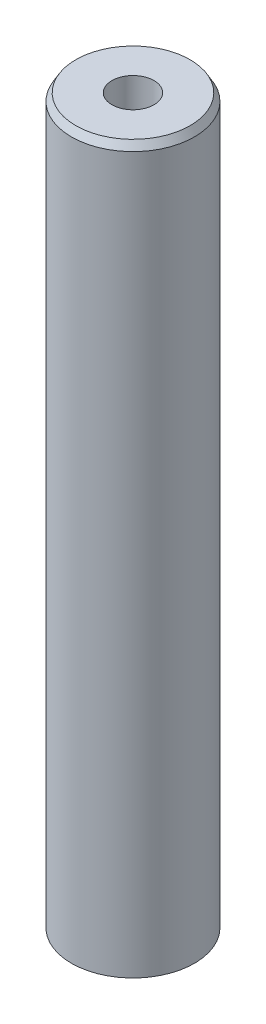
ISO-10303-21;
HEADER;
FILE_DESCRIPTION(('STEP AP214'),'2;1');
FILE_NAME('part.step','',(''),(''),'','','');
FILE_SCHEMA(('AUTOMOTIVE_DESIGN { 1 0 10303 214 1 1 1 1 }'));
ENDSEC;
DATA;
#1=APPLICATION_CONTEXT('core data for automotive mechanical design processes');
#2=APPLICATION_PROTOCOL_DEFINITION('international standard','automotive_design',2000,#1);
#3=PRODUCT_CONTEXT('',#1,'mechanical');
#4=PRODUCT('Part','Part','',(#3));
#5=PRODUCT_RELATED_PRODUCT_CATEGORY('part','',(#4));
#6=PRODUCT_DEFINITION_FORMATION('','',#4);
#7=PRODUCT_DEFINITION_CONTEXT('part definition',#1,'design');
#8=PRODUCT_DEFINITION('design','',#6,#7);
#9=PRODUCT_DEFINITION_SHAPE('','',#8);
#10=(LENGTH_UNIT() NAMED_UNIT(*) SI_UNIT(.MILLI.,.METRE.));
#11=(NAMED_UNIT(*) PLANE_ANGLE_UNIT() SI_UNIT($,.RADIAN.));
#12=(NAMED_UNIT(*) SI_UNIT($,.STERADIAN.) SOLID_ANGLE_UNIT());
#13=UNCERTAINTY_MEASURE_WITH_UNIT(LENGTH_MEASURE(1.E-05),#10,'distance_accuracy_value','');
#14=(GEOMETRIC_REPRESENTATION_CONTEXT(3) GLOBAL_UNCERTAINTY_ASSIGNED_CONTEXT((#13)) GLOBAL_UNIT_ASSIGNED_CONTEXT((#10,
#11,#12)) REPRESENTATION_CONTEXT('',''));
#15=CARTESIAN_POINT('',(0.,0.,0.));
#16=DIRECTION('',(0.,0.,1.));
#17=DIRECTION('',(1.,0.,0.));
#18=AXIS2_PLACEMENT_3D('',#15,#16,#17);
#19=CARTESIAN_POINT('',(0.,295.62713369764,0.));
#20=DIRECTION('',(0.,-1.,0.));
#21=DIRECTION('',(0.,0.,-1.));
#22=AXIS2_PLACEMENT_3D('',#19,#20,#21);
#23=CYLINDRICAL_SURFACE('',#22,25.);
#24=CARTESIAN_POINT('',(0.,292.552841641087,0.));
#25=DIRECTION('',(0.,1.,0.));
#26=DIRECTION('',(0.,0.,1.));
#27=AXIS2_PLACEMENT_3D('',#24,#25,#26);
#28=CIRCLE('',#27,25.);
#29=CARTESIAN_POINT('',(0.,292.552841641087,25.));
#30=VERTEX_POINT('',#29);
#31=EDGE_CURVE('E50',#30,#30,#28,.F.);
#32=ORIENTED_EDGE('',*,*,#31,.T.);
#33=EDGE_LOOP('',(#32));
#34=FACE_BOUND('',#33,.T.);
#35=CARTESIAN_POINT('',(0.,1.7749433464182,0.));
#36=DIRECTION('',(0.,1.,0.));
#37=DIRECTION('',(0.,0.,1.));
#38=AXIS2_PLACEMENT_3D('',#35,#36,#37);
#39=CIRCLE('',#38,25.);
#40=CARTESIAN_POINT('',(0.,1.7749433464182,25.));
#41=VERTEX_POINT('',#40);
#42=EDGE_CURVE('E51',#41,#41,#39,.T.);
#43=ORIENTED_EDGE('',*,*,#42,.T.);
#44=EDGE_LOOP('',(#43));
#45=FACE_BOUND('',#44,.T.);
#46=ADVANCED_FACE('F39',(#34,#45),#23,.T.);
#47=CARTESIAN_POINT('',(0.,295.62713369764,0.));
#48=DIRECTION('',(0.,1.,0.));
#49=DIRECTION('',(0.,0.,1.));
#50=AXIS2_PLACEMENT_3D('',#47,#48,#49);
#51=PLANE('',#50);
#52=CARTESIAN_POINT('',(0.,295.62713369764,0.));
#53=DIRECTION('',(0.,1.,0.));
#54=DIRECTION('',(0.,0.,1.));
#55=AXIS2_PLACEMENT_3D('',#52,#53,#54);
#56=CIRCLE('',#55,23.2250566535818);
#57=CARTESIAN_POINT('',(0.,295.62713369764,23.2250566535818));
#58=VERTEX_POINT('',#57);
#59=EDGE_CURVE('E54',#58,#58,#56,.T.);
#60=ORIENTED_EDGE('',*,*,#59,.T.);
#61=EDGE_LOOP('',(#60));
#62=FACE_BOUND('',#61,.T.);
#63=CARTESIAN_POINT('',(0.,295.62713369764,0.));
#64=DIRECTION('',(0.,1.,0.));
#65=DIRECTION('',(0.,0.,1.));
#66=AXIS2_PLACEMENT_3D('',#63,#64,#65);
#67=CIRCLE('',#66,8.53933382340606);
#68=CARTESIAN_POINT('',(0.,295.62713369764,8.53933382340606));
#69=VERTEX_POINT('',#68);
#70=EDGE_CURVE('E58',#69,#69,#67,.T.);
#71=ORIENTED_EDGE('',*,*,#70,.F.);
#72=EDGE_LOOP('',(#71));
#73=FACE_BOUND('',#72,.T.);
#74=ADVANCED_FACE('F69',(#62,#73),#51,.T.);
#75=CARTESIAN_POINT('',(0.,0.,0.));
#76=DIRECTION('',(0.,1.,0.));
#77=DIRECTION('',(0.,0.,1.));
#78=AXIS2_PLACEMENT_3D('',#75,#76,#77);
#79=PLANE('',#78);
#80=CARTESIAN_POINT('',(0.,0.,0.));
#81=DIRECTION('',(0.,1.,0.));
#82=DIRECTION('',(0.,0.,1.));
#83=AXIS2_PLACEMENT_3D('',#80,#81,#82);
#84=CIRCLE('',#83,21.9257079434473);
#85=CARTESIAN_POINT('',(0.,0.,21.9257079434473));
#86=VERTEX_POINT('',#85);
#87=EDGE_CURVE('E10',#86,#86,#84,.F.);
#88=ORIENTED_EDGE('',*,*,#87,.T.);
#89=EDGE_LOOP('',(#88));
#90=FACE_BOUND('',#89,.T.);
#91=CARTESIAN_POINT('',(0.,0.,0.));
#92=DIRECTION('',(0.,1.,0.));
#93=DIRECTION('',(0.,0.,1.));
#94=AXIS2_PLACEMENT_3D('',#91,#92,#93);
#95=CIRCLE('',#94,8.53933382340606);
#96=CARTESIAN_POINT('',(0.,0.,8.53933382340606));
#97=VERTEX_POINT('',#96);
#98=EDGE_CURVE('E63',#97,#97,#95,.T.);
#99=ORIENTED_EDGE('',*,*,#98,.T.);
#100=EDGE_LOOP('',(#99));
#101=FACE_BOUND('',#100,.T.);
#102=ADVANCED_FACE('F75',(#90,#101),#79,.F.);
#103=CARTESIAN_POINT('',(0.,295.62713369764,0.));
#104=DIRECTION('',(0.,-1.,0.));
#105=DIRECTION('',(0.,0.,-1.));
#106=AXIS2_PLACEMENT_3D('',#103,#104,#105);
#107=CYLINDRICAL_SURFACE('',#106,8.53933382340606);
#108=ORIENTED_EDGE('',*,*,#70,.T.);
#109=EDGE_LOOP('',(#108));
#110=FACE_BOUND('',#109,.T.);
#111=ORIENTED_EDGE('',*,*,#98,.F.);
#112=EDGE_LOOP('',(#111));
#113=FACE_BOUND('',#112,.T.);
#114=ADVANCED_FACE('F70',(#110,#113),#107,.F.);
#115=CARTESIAN_POINT('',(0.,295.62713369764,0.));
#116=DIRECTION('',(0.,-1.,0.));
#117=DIRECTION('',(0.,0.,-1.));
#118=AXIS2_PLACEMENT_3D('',#115,#116,#117);
#119=CONICAL_SURFACE('',#118,23.2250566535818,0.523598775598303);
#120=ORIENTED_EDGE('',*,*,#31,.F.);
#121=EDGE_LOOP('',(#120));
#122=FACE_BOUND('',#121,.T.);
#123=ORIENTED_EDGE('',*,*,#59,.F.);
#124=EDGE_LOOP('',(#123));
#125=FACE_BOUND('',#124,.T.);
#126=ADVANCED_FACE('F81',(#122,#125),#119,.T.);
#127=CARTESIAN_POINT('',(0.,1.7749433464182,0.));
#128=DIRECTION('',(0.,1.,0.));
#129=DIRECTION('',(0.,0.,1.));
#130=AXIS2_PLACEMENT_3D('',#127,#128,#129);
#131=CONICAL_SURFACE('',#130,25.,1.04719755119661);
#132=ORIENTED_EDGE('',*,*,#87,.F.);
#133=EDGE_LOOP('',(#132));
#134=FACE_BOUND('',#133,.T.);
#135=ORIENTED_EDGE('',*,*,#42,.F.);
#136=EDGE_LOOP('',(#135));
#137=FACE_BOUND('',#136,.T.);
#138=ADVANCED_FACE('F45',(#134,#137),#131,.T.);
#139=CLOSED_SHELL('',(#46,#74,#102,#114,#126,#138));
#140=MANIFOLD_SOLID_BREP('B2',#139);
#141=ADVANCED_BREP_SHAPE_REPRESENTATION('',(#18,#140),#14);
#142=SHAPE_DEFINITION_REPRESENTATION(#9,#141);
ENDSEC;
END-ISO-10303-21;
